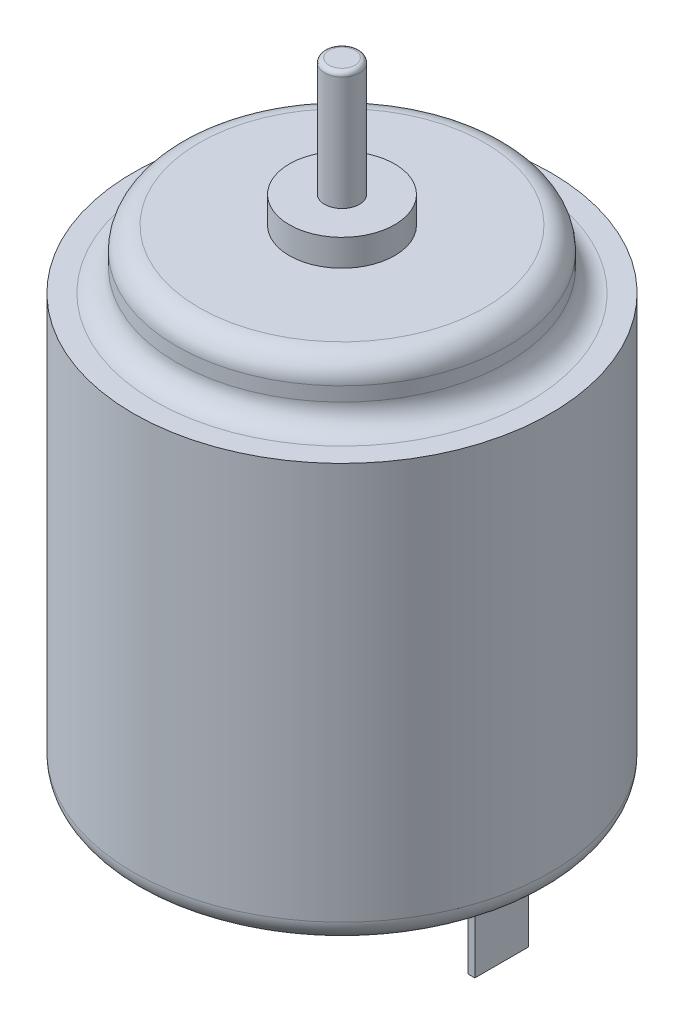
ISO-10303-21;
HEADER;
FILE_DESCRIPTION(('STEP AP214'),'2;1');
FILE_NAME('part.step','',(''),(''),'','','');
FILE_SCHEMA(('AUTOMOTIVE_DESIGN { 1 0 10303 214 1 1 1 1 }'));
ENDSEC;
DATA;
#1=APPLICATION_CONTEXT('core data for automotive mechanical design processes');
#2=APPLICATION_PROTOCOL_DEFINITION('international standard','automotive_design',2000,#1);
#3=PRODUCT_CONTEXT('',#1,'mechanical');
#4=PRODUCT('Part','Part','',(#3));
#5=PRODUCT_RELATED_PRODUCT_CATEGORY('part','',(#4));
#6=PRODUCT_DEFINITION_FORMATION('','',#4);
#7=PRODUCT_DEFINITION_CONTEXT('part definition',#1,'design');
#8=PRODUCT_DEFINITION('design','',#6,#7);
#9=PRODUCT_DEFINITION_SHAPE('','',#8);
#10=(LENGTH_UNIT() NAMED_UNIT(*) SI_UNIT(.MILLI.,.METRE.));
#11=(NAMED_UNIT(*) PLANE_ANGLE_UNIT() SI_UNIT($,.RADIAN.));
#12=(NAMED_UNIT(*) SI_UNIT($,.STERADIAN.) SOLID_ANGLE_UNIT());
#13=UNCERTAINTY_MEASURE_WITH_UNIT(LENGTH_MEASURE(1.E-05),#10,'distance_accuracy_value','');
#14=(GEOMETRIC_REPRESENTATION_CONTEXT(3) GLOBAL_UNCERTAINTY_ASSIGNED_CONTEXT((#13)) GLOBAL_UNIT_ASSIGNED_CONTEXT((#10,
#11,#12)) REPRESENTATION_CONTEXT('',''));
#15=CARTESIAN_POINT('',(0.,0.,0.));
#16=DIRECTION('',(0.,0.,1.));
#17=DIRECTION('',(1.,0.,0.));
#18=AXIS2_PLACEMENT_3D('',#15,#16,#17);
#19=CARTESIAN_POINT('',(0.,0.,0.));
#20=DIRECTION('',(0.,1.,0.));
#21=DIRECTION('',(0.,0.,1.));
#22=AXIS2_PLACEMENT_3D('',#19,#20,#21);
#23=PLANE('',#22);
#24=CARTESIAN_POINT('',(0.,0.,0.));
#25=DIRECTION('',(0.,1.,0.));
#26=DIRECTION('',(0.,0.,1.));
#27=AXIS2_PLACEMENT_3D('',#24,#25,#26);
#28=CIRCLE('',#27,10.6045);
#29=CARTESIAN_POINT('',(0.,0.,10.6045));
#30=VERTEX_POINT('',#29);
#31=EDGE_CURVE('E204',#30,#30,#28,.F.);
#32=ORIENTED_EDGE('',*,*,#31,.T.);
#33=EDGE_LOOP('',(#32));
#34=FACE_BOUND('',#33,.T.);
#35=DIRECTION('',(0.,0.,-1.));
#36=VECTOR('',#35,1.);
#37=CARTESIAN_POINT('',(-9.0805,0.,1.52400000000001));
#38=LINE('',#37,#36);
#39=CARTESIAN_POINT('',(-9.0805,0.,1.52400000000001));
#40=VERTEX_POINT('',#39);
#41=CARTESIAN_POINT('',(-9.0805,0.,-1.52399999999999));
#42=VERTEX_POINT('',#41);
#43=EDGE_CURVE('E135',#40,#42,#38,.T.);
#44=ORIENTED_EDGE('',*,*,#43,.F.);
#45=DIRECTION('',(-1.,0.,0.));
#46=VECTOR('',#45,1.);
#47=CARTESIAN_POINT('',(-8.6995,0.,1.52400000000001));
#48=LINE('',#47,#46);
#49=CARTESIAN_POINT('',(-8.6995,0.,1.52400000000001));
#50=VERTEX_POINT('',#49);
#51=EDGE_CURVE('E148',#50,#40,#48,.T.);
#52=ORIENTED_EDGE('',*,*,#51,.F.);
#53=DIRECTION('',(0.,0.,1.));
#54=VECTOR('',#53,1.);
#55=CARTESIAN_POINT('',(-8.6995,0.,1.52400000000001));
#56=LINE('',#55,#54);
#57=CARTESIAN_POINT('',(-8.6995,0.,-1.52399999999999));
#58=VERTEX_POINT('',#57);
#59=EDGE_CURVE('E157',#58,#50,#56,.T.);
#60=ORIENTED_EDGE('',*,*,#59,.F.);
#61=DIRECTION('',(1.,0.,0.));
#62=VECTOR('',#61,1.);
#63=CARTESIAN_POINT('',(-8.6995,0.,-1.52399999999999));
#64=LINE('',#63,#62);
#65=EDGE_CURVE('E138',#42,#58,#64,.T.);
#66=ORIENTED_EDGE('',*,*,#65,.F.);
#67=EDGE_LOOP('',(#44,#52,#60,#66));
#68=FACE_BOUND('',#67,.T.);
#69=CARTESIAN_POINT('',(0.,0.,0.));
#70=DIRECTION('',(0.,1.,0.));
#71=DIRECTION('',(0.,0.,1.));
#72=AXIS2_PLACEMENT_3D('',#69,#70,#71);
#73=CIRCLE('',#72,4.2926);
#74=CARTESIAN_POINT('',(-2.16198617016854,0.,3.7084));
#75=VERTEX_POINT('',#74);
#76=CARTESIAN_POINT('',(2.16198617016854,0.,3.7084));
#77=VERTEX_POINT('',#76);
#78=EDGE_CURVE('E198',#75,#77,#73,.F.);
#79=ORIENTED_EDGE('',*,*,#78,.F.);
#80=DIRECTION('',(1.,0.,0.));
#81=VECTOR('',#80,1.);
#82=CARTESIAN_POINT('',(2.16198617016854,0.,3.7084));
#83=LINE('',#82,#81);
#84=EDGE_CURVE('E174',#75,#77,#83,.T.);
#85=ORIENTED_EDGE('',*,*,#84,.T.);
#86=EDGE_LOOP('',(#79,#85));
#87=FACE_BOUND('',#86,.T.);
#88=DIRECTION('',(0.,0.,-1.));
#89=VECTOR('',#88,1.);
#90=CARTESIAN_POINT('',(8.6995,0.,1.52400000000001));
#91=LINE('',#90,#89);
#92=CARTESIAN_POINT('',(8.6995,0.,1.52400000000001));
#93=VERTEX_POINT('',#92);
#94=CARTESIAN_POINT('',(8.6995,0.,-1.52399999999999));
#95=VERTEX_POINT('',#94);
#96=EDGE_CURVE('E134',#93,#95,#91,.T.);
#97=ORIENTED_EDGE('',*,*,#96,.F.);
#98=DIRECTION('',(-1.,0.,0.));
#99=VECTOR('',#98,1.);
#100=CARTESIAN_POINT('',(8.6995,0.,1.52400000000001));
#101=LINE('',#100,#99);
#102=CARTESIAN_POINT('',(9.0805,0.,1.52400000000001));
#103=VERTEX_POINT('',#102);
#104=EDGE_CURVE('E131',#103,#93,#101,.T.);
#105=ORIENTED_EDGE('',*,*,#104,.F.);
#106=DIRECTION('',(0.,0.,1.));
#107=VECTOR('',#106,1.);
#108=CARTESIAN_POINT('',(9.0805,0.,1.52400000000001));
#109=LINE('',#108,#107);
#110=CARTESIAN_POINT('',(9.0805,0.,-1.52399999999999));
#111=VERTEX_POINT('',#110);
#112=EDGE_CURVE('E57',#111,#103,#109,.T.);
#113=ORIENTED_EDGE('',*,*,#112,.F.);
#114=DIRECTION('',(1.,0.,0.));
#115=VECTOR('',#114,1.);
#116=CARTESIAN_POINT('',(8.6995,0.,-1.52399999999999));
#117=LINE('',#116,#115);
#118=EDGE_CURVE('E52',#95,#111,#117,.T.);
#119=ORIENTED_EDGE('',*,*,#118,.F.);
#120=EDGE_LOOP('',(#97,#105,#113,#119));
#121=FACE_BOUND('',#120,.T.);
#122=ADVANCED_FACE('F37',(#34,#68,#87,#121),#23,.F.);
#123=CARTESIAN_POINT('',(0.,23.876,0.));
#124=DIRECTION('',(0.,-1.,0.));
#125=DIRECTION('',(0.,0.,-1.));
#126=AXIS2_PLACEMENT_3D('',#123,#124,#125);
#127=CYLINDRICAL_SURFACE('',#126,11.8745);
#128=CARTESIAN_POINT('',(0.,1.27,0.));
#129=DIRECTION('',(0.,1.,0.));
#130=DIRECTION('',(0.,0.,1.));
#131=AXIS2_PLACEMENT_3D('',#128,#129,#130);
#132=CIRCLE('',#131,11.8745);
#133=CARTESIAN_POINT('',(0.,1.27,11.8745));
#134=VERTEX_POINT('',#133);
#135=EDGE_CURVE('E201',#134,#134,#132,.T.);
#136=ORIENTED_EDGE('',*,*,#135,.T.);
#137=EDGE_LOOP('',(#136));
#138=FACE_BOUND('',#137,.T.);
#139=CARTESIAN_POINT('',(0.,23.876,0.));
#140=DIRECTION('',(0.,1.,0.));
#141=DIRECTION('',(0.,0.,1.));
#142=AXIS2_PLACEMENT_3D('',#139,#140,#141);
#143=CIRCLE('',#142,11.8745);
#144=CARTESIAN_POINT('',(0.,23.876,11.8745));
#145=VERTEX_POINT('',#144);
#146=EDGE_CURVE('E193',#145,#145,#143,.T.);
#147=ORIENTED_EDGE('',*,*,#146,.F.);
#148=EDGE_LOOP('',(#147));
#149=FACE_BOUND('',#148,.T.);
#150=ADVANCED_FACE('F233',(#138,#149),#127,.T.);
#151=CARTESIAN_POINT('',(0.,23.876,0.));
#152=DIRECTION('',(0.,1.,0.));
#153=DIRECTION('',(0.,0.,1.));
#154=AXIS2_PLACEMENT_3D('',#151,#152,#153);
#155=PLANE('',#154);
#156=CARTESIAN_POINT('',(0.,23.876,0.));
#157=DIRECTION('',(0.,1.,0.));
#158=DIRECTION('',(0.,0.,1.));
#159=AXIS2_PLACEMENT_3D('',#156,#157,#158);
#160=CIRCLE('',#159,10.668);
#161=CARTESIAN_POINT('',(0.,23.876,10.668));
#162=VERTEX_POINT('',#161);
#163=EDGE_CURVE('E216',#162,#162,#160,.F.);
#164=ORIENTED_EDGE('',*,*,#163,.T.);
#165=EDGE_LOOP('',(#164));
#166=FACE_BOUND('',#165,.T.);
#167=ORIENTED_EDGE('',*,*,#146,.T.);
#168=EDGE_LOOP('',(#167));
#169=FACE_BOUND('',#168,.T.);
#170=ADVANCED_FACE('F239',(#166,#169),#155,.T.);
#171=CARTESIAN_POINT('',(0.,27.2161,0.));
#172=DIRECTION('',(0.,-1.,0.));
#173=DIRECTION('',(0.,0.,-1.));
#174=AXIS2_PLACEMENT_3D('',#171,#172,#173);
#175=CYLINDRICAL_SURFACE('',#174,9.398);
#176=CARTESIAN_POINT('',(0.,25.9461,0.));
#177=DIRECTION('',(0.,1.,0.));
#178=DIRECTION('',(0.,0.,1.));
#179=AXIS2_PLACEMENT_3D('',#176,#177,#178);
#180=CIRCLE('',#179,9.398);
#181=CARTESIAN_POINT('',(0.,25.9461,9.398));
#182=VERTEX_POINT('',#181);
#183=EDGE_CURVE('E213',#182,#182,#180,.F.);
#184=ORIENTED_EDGE('',*,*,#183,.T.);
#185=EDGE_LOOP('',(#184));
#186=FACE_BOUND('',#185,.T.);
#187=CARTESIAN_POINT('',(0.,25.146,0.));
#188=DIRECTION('',(0.,1.,0.));
#189=DIRECTION('',(0.,0.,1.));
#190=AXIS2_PLACEMENT_3D('',#187,#188,#189);
#191=CIRCLE('',#190,9.398);
#192=CARTESIAN_POINT('',(0.,25.146,9.398));
#193=VERTEX_POINT('',#192);
#194=EDGE_CURVE('E210',#193,#193,#191,.T.);
#195=ORIENTED_EDGE('',*,*,#194,.T.);
#196=EDGE_LOOP('',(#195));
#197=FACE_BOUND('',#196,.T.);
#198=ADVANCED_FACE('F262',(#186,#197),#175,.T.);
#199=CARTESIAN_POINT('',(0.,27.2161,0.));
#200=DIRECTION('',(0.,1.,0.));
#201=DIRECTION('',(0.,0.,1.));
#202=AXIS2_PLACEMENT_3D('',#199,#200,#201);
#203=PLANE('',#202);
#204=CARTESIAN_POINT('',(0.,27.2161,0.));
#205=DIRECTION('',(0.,1.,0.));
#206=DIRECTION('',(0.,0.,1.));
#207=AXIS2_PLACEMENT_3D('',#204,#205,#206);
#208=CIRCLE('',#207,8.128);
#209=CARTESIAN_POINT('',(0.,27.2161,8.128));
#210=VERTEX_POINT('',#209);
#211=EDGE_CURVE('E207',#210,#210,#208,.T.);
#212=ORIENTED_EDGE('',*,*,#211,.T.);
#213=EDGE_LOOP('',(#212));
#214=FACE_BOUND('',#213,.T.);
#215=CARTESIAN_POINT('',(0.,27.2161,0.));
#216=DIRECTION('',(0.,1.,0.));
#217=DIRECTION('',(0.,0.,1.));
#218=AXIS2_PLACEMENT_3D('',#215,#216,#217);
#219=CIRCLE('',#218,2.9972);
#220=CARTESIAN_POINT('',(0.,27.2161,2.9972));
#221=VERTEX_POINT('',#220);
#222=EDGE_CURVE('E189',#221,#221,#219,.T.);
#223=ORIENTED_EDGE('',*,*,#222,.F.);
#224=EDGE_LOOP('',(#223));
#225=FACE_BOUND('',#224,.T.);
#226=ADVANCED_FACE('F258',(#214,#225),#203,.T.);
#227=CARTESIAN_POINT('',(0.,28.7401,0.));
#228=DIRECTION('',(0.,-1.,0.));
#229=DIRECTION('',(0.,0.,-1.));
#230=AXIS2_PLACEMENT_3D('',#227,#228,#229);
#231=CYLINDRICAL_SURFACE('',#230,2.9972);
#232=CARTESIAN_POINT('',(0.,28.7401,0.));
#233=DIRECTION('',(0.,1.,0.));
#234=DIRECTION('',(0.,0.,1.));
#235=AXIS2_PLACEMENT_3D('',#232,#233,#234);
#236=CIRCLE('',#235,2.9972);
#237=CARTESIAN_POINT('',(0.,28.7401,2.9972));
#238=VERTEX_POINT('',#237);
#239=EDGE_CURVE('E190',#238,#238,#236,.T.);
#240=ORIENTED_EDGE('',*,*,#239,.F.);
#241=EDGE_LOOP('',(#240));
#242=FACE_BOUND('',#241,.T.);
#243=ORIENTED_EDGE('',*,*,#222,.T.);
#244=EDGE_LOOP('',(#243));
#245=FACE_BOUND('',#244,.T.);
#246=ADVANCED_FACE('F261',(#242,#245),#231,.T.);
#247=CARTESIAN_POINT('',(0.,28.7401,0.));
#248=DIRECTION('',(0.,1.,0.));
#249=DIRECTION('',(0.,0.,1.));
#250=AXIS2_PLACEMENT_3D('',#247,#248,#249);
#251=PLANE('',#250);
#252=CARTESIAN_POINT('',(0.,28.7401,0.));
#253=DIRECTION('',(0.,1.,0.));
#254=DIRECTION('',(0.,0.,1.));
#255=AXIS2_PLACEMENT_3D('',#252,#253,#254);
#256=CIRCLE('',#255,0.9906);
#257=CARTESIAN_POINT('',(0.,28.7401,0.9906));
#258=VERTEX_POINT('',#257);
#259=EDGE_CURVE('E186',#258,#258,#256,.T.);
#260=ORIENTED_EDGE('',*,*,#259,.F.);
#261=EDGE_LOOP('',(#260));
#262=FACE_BOUND('',#261,.T.);
#263=ORIENTED_EDGE('',*,*,#239,.T.);
#264=EDGE_LOOP('',(#263));
#265=FACE_BOUND('',#264,.T.);
#266=ADVANCED_FACE('F267',(#262,#265),#251,.T.);
#267=CARTESIAN_POINT('',(0.,35.4711,0.));
#268=DIRECTION('',(0.,-1.,0.));
#269=DIRECTION('',(0.,0.,-1.));
#270=AXIS2_PLACEMENT_3D('',#267,#268,#269);
#271=CYLINDRICAL_SURFACE('',#270,0.9906);
#272=CARTESIAN_POINT('',(0.,35.2171,0.));
#273=DIRECTION('',(0.,1.,0.));
#274=DIRECTION('',(0.,0.,1.));
#275=AXIS2_PLACEMENT_3D('',#272,#273,#274);
#276=CIRCLE('',#275,0.9906);
#277=CARTESIAN_POINT('',(0.,35.2171,0.9906));
#278=VERTEX_POINT('',#277);
#279=EDGE_CURVE('E11',#278,#278,#276,.F.);
#280=ORIENTED_EDGE('',*,*,#279,.T.);
#281=EDGE_LOOP('',(#280));
#282=FACE_BOUND('',#281,.T.);
#283=ORIENTED_EDGE('',*,*,#259,.T.);
#284=EDGE_LOOP('',(#283));
#285=FACE_BOUND('',#284,.T.);
#286=ADVANCED_FACE('F273',(#282,#285),#271,.T.);
#287=CARTESIAN_POINT('',(0.,35.4711,0.));
#288=DIRECTION('',(0.,1.,0.));
#289=DIRECTION('',(0.,0.,1.));
#290=AXIS2_PLACEMENT_3D('',#287,#288,#289);
#291=PLANE('',#290);
#292=CARTESIAN_POINT('',(0.,35.4711,0.));
#293=DIRECTION('',(0.,1.,0.));
#294=DIRECTION('',(0.,0.,1.));
#295=AXIS2_PLACEMENT_3D('',#292,#293,#294);
#296=CIRCLE('',#295,0.7366);
#297=CARTESIAN_POINT('',(0.,35.4711,0.7366));
#298=VERTEX_POINT('',#297);
#299=EDGE_CURVE('E45',#298,#298,#296,.T.);
#300=ORIENTED_EDGE('',*,*,#299,.T.);
#301=EDGE_LOOP('',(#300));
#302=FACE_BOUND('',#301,.T.);
#303=ADVANCED_FACE('F221',(#302),#291,.T.);
#304=CARTESIAN_POINT('',(0.,-2.032,0.));
#305=DIRECTION('',(0.,1.,0.));
#306=DIRECTION('',(0.,0.,1.));
#307=AXIS2_PLACEMENT_3D('',#304,#305,#306);
#308=CYLINDRICAL_SURFACE('',#307,4.2926);
#309=CARTESIAN_POINT('',(0.,-2.032,0.));
#310=DIRECTION('',(0.,-1.,0.));
#311=DIRECTION('',(0.,0.,-1.));
#312=AXIS2_PLACEMENT_3D('',#309,#310,#311);
#313=CIRCLE('',#312,4.2926);
#314=CARTESIAN_POINT('',(-2.16198617016854,-2.032,3.7084));
#315=VERTEX_POINT('',#314);
#316=CARTESIAN_POINT('',(2.16198617016854,-2.032,3.7084));
#317=VERTEX_POINT('',#316);
#318=EDGE_CURVE('E182',#315,#317,#313,.T.);
#319=ORIENTED_EDGE('',*,*,#318,.F.);
#320=DIRECTION('',(0.,-1.,0.));
#321=VECTOR('',#320,1.);
#322=CARTESIAN_POINT('',(-2.16198617016854,0.,3.7084));
#323=LINE('',#322,#321);
#324=EDGE_CURVE('E177',#75,#315,#323,.T.);
#325=ORIENTED_EDGE('',*,*,#324,.F.);
#326=ORIENTED_EDGE('',*,*,#78,.T.);
#327=DIRECTION('',(0.,-1.,0.));
#328=VECTOR('',#327,1.);
#329=CARTESIAN_POINT('',(2.16198617016854,0.,3.7084));
#330=LINE('',#329,#328);
#331=EDGE_CURVE('E179',#77,#317,#330,.T.);
#332=ORIENTED_EDGE('',*,*,#331,.T.);
#333=EDGE_LOOP('',(#319,#325,#326,#332));
#334=FACE_BOUND('',#333,.T.);
#335=ADVANCED_FACE('F423',(#334),#308,.T.);
#336=CARTESIAN_POINT('',(0.,-2.032,0.));
#337=DIRECTION('',(0.,-1.,0.));
#338=DIRECTION('',(0.,0.,-1.));
#339=AXIS2_PLACEMENT_3D('',#336,#337,#338);
#340=PLANE('',#339);
#341=DIRECTION('',(1.,0.,0.));
#342=VECTOR('',#341,1.);
#343=CARTESIAN_POINT('',(2.16198617016854,-2.032,3.7084));
#344=LINE('',#343,#342);
#345=EDGE_CURVE('E173',#315,#317,#344,.T.);
#346=ORIENTED_EDGE('',*,*,#345,.F.);
#347=ORIENTED_EDGE('',*,*,#318,.T.);
#348=EDGE_LOOP('',(#346,#347));
#349=FACE_BOUND('',#348,.T.);
#350=ADVANCED_FACE('F414',(#349),#340,.T.);
#351=CARTESIAN_POINT('',(2.16198617016854,0.,3.7084));
#352=DIRECTION('',(0.,0.,-1.));
#353=DIRECTION('',(-1.,0.,0.));
#354=AXIS2_PLACEMENT_3D('',#351,#352,#353);
#355=PLANE('',#354);
#356=ORIENTED_EDGE('',*,*,#345,.T.);
#357=ORIENTED_EDGE('',*,*,#331,.F.);
#358=ORIENTED_EDGE('',*,*,#84,.F.);
#359=ORIENTED_EDGE('',*,*,#324,.T.);
#360=EDGE_LOOP('',(#356,#357,#358,#359));
#361=FACE_BOUND('',#360,.T.);
#362=ADVANCED_FACE('F407',(#361),#355,.F.);
#363=CARTESIAN_POINT('',(-9.0805,-4.572,1.52400000000001));
#364=DIRECTION('',(1.,0.,0.));
#365=DIRECTION('',(0.,0.,-1.));
#366=AXIS2_PLACEMENT_3D('',#363,#364,#365);
#367=PLANE('',#366);
#368=ORIENTED_EDGE('',*,*,#43,.T.);
#369=DIRECTION('',(0.,1.,0.));
#370=VECTOR('',#369,1.);
#371=CARTESIAN_POINT('',(-9.0805,-4.572,-1.52399999999999));
#372=LINE('',#371,#370);
#373=CARTESIAN_POINT('',(-9.0805,-4.572,-1.52399999999999));
#374=VERTEX_POINT('',#373);
#375=EDGE_CURVE('E170',#374,#42,#372,.T.);
#376=ORIENTED_EDGE('',*,*,#375,.F.);
#377=DIRECTION('',(0.,0.,-1.));
#378=VECTOR('',#377,1.);
#379=CARTESIAN_POINT('',(-9.0805,-4.572,1.52400000000001));
#380=LINE('',#379,#378);
#381=CARTESIAN_POINT('',(-9.0805,-4.572,1.52400000000001));
#382=VERTEX_POINT('',#381);
#383=EDGE_CURVE('E144',#382,#374,#380,.T.);
#384=ORIENTED_EDGE('',*,*,#383,.F.);
#385=DIRECTION('',(0.,1.,0.));
#386=VECTOR('',#385,1.);
#387=CARTESIAN_POINT('',(-9.0805,-4.572,1.52400000000001));
#388=LINE('',#387,#386);
#389=EDGE_CURVE('E153',#382,#40,#388,.T.);
#390=ORIENTED_EDGE('',*,*,#389,.T.);
#391=EDGE_LOOP('',(#368,#376,#384,#390));
#392=FACE_BOUND('',#391,.T.);
#393=ADVANCED_FACE('F400',(#392),#367,.F.);
#394=CARTESIAN_POINT('',(-8.6995,-4.572,-1.52399999999999));
#395=DIRECTION('',(0.,0.,1.));
#396=DIRECTION('',(1.,0.,0.));
#397=AXIS2_PLACEMENT_3D('',#394,#395,#396);
#398=PLANE('',#397);
#399=ORIENTED_EDGE('',*,*,#65,.T.);
#400=DIRECTION('',(0.,1.,0.));
#401=VECTOR('',#400,1.);
#402=CARTESIAN_POINT('',(-8.6995,-4.572,-1.52399999999999));
#403=LINE('',#402,#401);
#404=CARTESIAN_POINT('',(-8.6995,-4.572,-1.52399999999999));
#405=VERTEX_POINT('',#404);
#406=EDGE_CURVE('E167',#405,#58,#403,.T.);
#407=ORIENTED_EDGE('',*,*,#406,.F.);
#408=DIRECTION('',(1.,0.,0.));
#409=VECTOR('',#408,1.);
#410=CARTESIAN_POINT('',(-8.6995,-4.572,-1.52399999999999));
#411=LINE('',#410,#409);
#412=EDGE_CURVE('E147',#374,#405,#411,.T.);
#413=ORIENTED_EDGE('',*,*,#412,.F.);
#414=ORIENTED_EDGE('',*,*,#375,.T.);
#415=EDGE_LOOP('',(#399,#407,#413,#414));
#416=FACE_BOUND('',#415,.T.);
#417=ADVANCED_FACE('F392',(#416),#398,.F.);
#418=CARTESIAN_POINT('',(-8.6995,-4.572,1.52400000000001));
#419=DIRECTION('',(-1.,0.,0.));
#420=DIRECTION('',(0.,0.,1.));
#421=AXIS2_PLACEMENT_3D('',#418,#419,#420);
#422=PLANE('',#421);
#423=ORIENTED_EDGE('',*,*,#59,.T.);
#424=DIRECTION('',(0.,1.,0.));
#425=VECTOR('',#424,1.);
#426=CARTESIAN_POINT('',(-8.6995,-4.572,1.52400000000001));
#427=LINE('',#426,#425);
#428=CARTESIAN_POINT('',(-8.6995,-4.572,1.52400000000001));
#429=VERTEX_POINT('',#428);
#430=EDGE_CURVE('E164',#429,#50,#427,.T.);
#431=ORIENTED_EDGE('',*,*,#430,.F.);
#432=DIRECTION('',(0.,0.,1.));
#433=VECTOR('',#432,1.);
#434=CARTESIAN_POINT('',(-8.6995,-4.572,1.52400000000001));
#435=LINE('',#434,#433);
#436=EDGE_CURVE('E150',#405,#429,#435,.T.);
#437=ORIENTED_EDGE('',*,*,#436,.F.);
#438=ORIENTED_EDGE('',*,*,#406,.T.);
#439=EDGE_LOOP('',(#423,#431,#437,#438));
#440=FACE_BOUND('',#439,.T.);
#441=ADVANCED_FACE('F385',(#440),#422,.F.);
#442=CARTESIAN_POINT('',(-8.6995,-4.572,1.52400000000001));
#443=DIRECTION('',(0.,0.,-1.));
#444=DIRECTION('',(-1.,0.,0.));
#445=AXIS2_PLACEMENT_3D('',#442,#443,#444);
#446=PLANE('',#445);
#447=ORIENTED_EDGE('',*,*,#51,.T.);
#448=ORIENTED_EDGE('',*,*,#389,.F.);
#449=DIRECTION('',(-1.,0.,0.));
#450=VECTOR('',#449,1.);
#451=CARTESIAN_POINT('',(-8.6995,-4.572,1.52400000000001));
#452=LINE('',#451,#450);
#453=EDGE_CURVE('E152',#429,#382,#452,.T.);
#454=ORIENTED_EDGE('',*,*,#453,.F.);
#455=ORIENTED_EDGE('',*,*,#430,.T.);
#456=EDGE_LOOP('',(#447,#448,#454,#455));
#457=FACE_BOUND('',#456,.T.);
#458=ADVANCED_FACE('F376',(#457),#446,.F.);
#459=CARTESIAN_POINT('',(0.,-4.572,0.));
#460=DIRECTION('',(0.,1.,0.));
#461=DIRECTION('',(0.,0.,1.));
#462=AXIS2_PLACEMENT_3D('',#459,#460,#461);
#463=PLANE('',#462);
#464=ORIENTED_EDGE('',*,*,#383,.T.);
#465=ORIENTED_EDGE('',*,*,#412,.T.);
#466=ORIENTED_EDGE('',*,*,#436,.T.);
#467=ORIENTED_EDGE('',*,*,#453,.T.);
#468=EDGE_LOOP('',(#464,#465,#466,#467));
#469=FACE_BOUND('',#468,.T.);
#470=ADVANCED_FACE('F369',(#469),#463,.F.);
#471=CARTESIAN_POINT('',(8.6995,-4.572,1.52400000000001));
#472=DIRECTION('',(1.,0.,0.));
#473=DIRECTION('',(0.,0.,-1.));
#474=AXIS2_PLACEMENT_3D('',#471,#472,#473);
#475=PLANE('',#474);
#476=ORIENTED_EDGE('',*,*,#96,.T.);
#477=DIRECTION('',(0.,1.,0.));
#478=VECTOR('',#477,1.);
#479=CARTESIAN_POINT('',(8.6995,-4.572,-1.52399999999999));
#480=LINE('',#479,#478);
#481=CARTESIAN_POINT('',(8.6995,-4.572,-1.52399999999999));
#482=VERTEX_POINT('',#481);
#483=EDGE_CURVE('E115',#482,#95,#480,.T.);
#484=ORIENTED_EDGE('',*,*,#483,.F.);
#485=DIRECTION('',(0.,0.,-1.));
#486=VECTOR('',#485,1.);
#487=CARTESIAN_POINT('',(8.6995,-4.572,1.52400000000001));
#488=LINE('',#487,#486);
#489=CARTESIAN_POINT('',(8.6995,-4.572,1.52400000000001));
#490=VERTEX_POINT('',#489);
#491=EDGE_CURVE('E122',#490,#482,#488,.T.);
#492=ORIENTED_EDGE('',*,*,#491,.F.);
#493=DIRECTION('',(0.,1.,0.));
#494=VECTOR('',#493,1.);
#495=CARTESIAN_POINT('',(8.6995,-4.572,1.52400000000001));
#496=LINE('',#495,#494);
#497=EDGE_CURVE('E543',#490,#93,#496,.T.);
#498=ORIENTED_EDGE('',*,*,#497,.T.);
#499=EDGE_LOOP('',(#476,#484,#492,#498));
#500=FACE_BOUND('',#499,.T.);
#501=ADVANCED_FACE('F133',(#500),#475,.F.);
#502=CARTESIAN_POINT('',(8.6995,-4.572,-1.52399999999999));
#503=DIRECTION('',(0.,0.,1.));
#504=DIRECTION('',(1.,0.,0.));
#505=AXIS2_PLACEMENT_3D('',#502,#503,#504);
#506=PLANE('',#505);
#507=ORIENTED_EDGE('',*,*,#118,.T.);
#508=DIRECTION('',(0.,1.,0.));
#509=VECTOR('',#508,1.);
#510=CARTESIAN_POINT('',(9.0805,-4.572,-1.52399999999999));
#511=LINE('',#510,#509);
#512=CARTESIAN_POINT('',(9.0805,-4.572,-1.52399999999999));
#513=VERTEX_POINT('',#512);
#514=EDGE_CURVE('E118',#513,#111,#511,.T.);
#515=ORIENTED_EDGE('',*,*,#514,.F.);
#516=DIRECTION('',(1.,0.,0.));
#517=VECTOR('',#516,1.);
#518=CARTESIAN_POINT('',(8.6995,-4.572,-1.52399999999999));
#519=LINE('',#518,#517);
#520=EDGE_CURVE('E111',#482,#513,#519,.T.);
#521=ORIENTED_EDGE('',*,*,#520,.F.);
#522=ORIENTED_EDGE('',*,*,#483,.T.);
#523=EDGE_LOOP('',(#507,#515,#521,#522));
#524=FACE_BOUND('',#523,.T.);
#525=ADVANCED_FACE('F113',(#524),#506,.F.);
#526=CARTESIAN_POINT('',(9.0805,-4.572,1.52400000000001));
#527=DIRECTION('',(-1.,0.,0.));
#528=DIRECTION('',(0.,0.,1.));
#529=AXIS2_PLACEMENT_3D('',#526,#527,#528);
#530=PLANE('',#529);
#531=ORIENTED_EDGE('',*,*,#112,.T.);
#532=DIRECTION('',(0.,1.,0.));
#533=VECTOR('',#532,1.);
#534=CARTESIAN_POINT('',(9.0805,-4.572,1.52400000000001));
#535=LINE('',#534,#533);
#536=CARTESIAN_POINT('',(9.0805,-4.572,1.52400000000001));
#537=VERTEX_POINT('',#536);
#538=EDGE_CURVE('E140',#537,#103,#535,.T.);
#539=ORIENTED_EDGE('',*,*,#538,.F.);
#540=DIRECTION('',(0.,0.,1.));
#541=VECTOR('',#540,1.);
#542=CARTESIAN_POINT('',(9.0805,-4.572,1.52400000000001));
#543=LINE('',#542,#541);
#544=EDGE_CURVE('E121',#513,#537,#543,.T.);
#545=ORIENTED_EDGE('',*,*,#544,.F.);
#546=ORIENTED_EDGE('',*,*,#514,.T.);
#547=EDGE_LOOP('',(#531,#539,#545,#546));
#548=FACE_BOUND('',#547,.T.);
#549=ADVANCED_FACE('F348',(#548),#530,.F.);
#550=CARTESIAN_POINT('',(8.6995,-4.572,1.52400000000001));
#551=DIRECTION('',(0.,0.,-1.));
#552=DIRECTION('',(-1.,0.,0.));
#553=AXIS2_PLACEMENT_3D('',#550,#551,#552);
#554=PLANE('',#553);
#555=ORIENTED_EDGE('',*,*,#104,.T.);
#556=ORIENTED_EDGE('',*,*,#497,.F.);
#557=DIRECTION('',(-1.,0.,0.));
#558=VECTOR('',#557,1.);
#559=CARTESIAN_POINT('',(8.6995,-4.572,1.52400000000001));
#560=LINE('',#559,#558);
#561=EDGE_CURVE('E127',#537,#490,#560,.T.);
#562=ORIENTED_EDGE('',*,*,#561,.F.);
#563=ORIENTED_EDGE('',*,*,#538,.T.);
#564=EDGE_LOOP('',(#555,#556,#562,#563));
#565=FACE_BOUND('',#564,.T.);
#566=ADVANCED_FACE('F340',(#565),#554,.F.);
#567=CARTESIAN_POINT('',(0.,-4.572,0.));
#568=DIRECTION('',(0.,-1.,0.));
#569=DIRECTION('',(0.,0.,-1.));
#570=AXIS2_PLACEMENT_3D('',#567,#568,#569);
#571=PLANE('',#570);
#572=ORIENTED_EDGE('',*,*,#491,.T.);
#573=ORIENTED_EDGE('',*,*,#520,.T.);
#574=ORIENTED_EDGE('',*,*,#544,.T.);
#575=ORIENTED_EDGE('',*,*,#561,.T.);
#576=EDGE_LOOP('',(#572,#573,#574,#575));
#577=FACE_BOUND('',#576,.T.);
#578=ADVANCED_FACE('F125',(#577),#571,.T.);
#579=CARTESIAN_POINT('',(0.,1.27,0.));
#580=DIRECTION('',(0.,1.,0.));
#581=DIRECTION('',(0.,0.,1.));
#582=AXIS2_PLACEMENT_3D('',#579,#580,#581);
#583=TOROIDAL_SURFACE('',#582,10.6045,1.27);
#584=ORIENTED_EDGE('',*,*,#31,.F.);
#585=EDGE_LOOP('',(#584));
#586=FACE_BOUND('',#585,.T.);
#587=ORIENTED_EDGE('',*,*,#135,.F.);
#588=EDGE_LOOP('',(#587));
#589=FACE_BOUND('',#588,.T.);
#590=ADVANCED_FACE('F246',(#586,#589),#583,.T.);
#591=CARTESIAN_POINT('',(0.,25.9461,0.));
#592=DIRECTION('',(0.,1.,0.));
#593=DIRECTION('',(0.,0.,1.));
#594=AXIS2_PLACEMENT_3D('',#591,#592,#593);
#595=TOROIDAL_SURFACE('',#594,8.128,1.27);
#596=ORIENTED_EDGE('',*,*,#183,.F.);
#597=EDGE_LOOP('',(#596));
#598=FACE_BOUND('',#597,.T.);
#599=ORIENTED_EDGE('',*,*,#211,.F.);
#600=EDGE_LOOP('',(#599));
#601=FACE_BOUND('',#600,.T.);
#602=ADVANCED_FACE('F229',(#598,#601),#595,.T.);
#603=CARTESIAN_POINT('',(0.,25.146,0.));
#604=DIRECTION('',(0.,1.,0.));
#605=DIRECTION('',(0.,0.,1.));
#606=AXIS2_PLACEMENT_3D('',#603,#604,#605);
#607=TOROIDAL_SURFACE('',#606,10.668,1.27);
#608=ORIENTED_EDGE('',*,*,#163,.F.);
#609=EDGE_LOOP('',(#608));
#610=FACE_BOUND('',#609,.T.);
#611=ORIENTED_EDGE('',*,*,#194,.F.);
#612=EDGE_LOOP('',(#611));
#613=FACE_BOUND('',#612,.T.);
#614=ADVANCED_FACE('F224',(#610,#613),#607,.F.);
#615=CARTESIAN_POINT('',(0.,35.2171,0.));
#616=DIRECTION('',(0.,1.,0.));
#617=DIRECTION('',(0.,0.,1.));
#618=AXIS2_PLACEMENT_3D('',#615,#616,#617);
#619=TOROIDAL_SURFACE('',#618,0.7366,0.254);
#620=ORIENTED_EDGE('',*,*,#279,.F.);
#621=EDGE_LOOP('',(#620));
#622=FACE_BOUND('',#621,.T.);
#623=ORIENTED_EDGE('',*,*,#299,.F.);
#624=EDGE_LOOP('',(#623));
#625=FACE_BOUND('',#624,.T.);
#626=ADVANCED_FACE('F39',(#622,#625),#619,.T.);
#627=CLOSED_SHELL('',(#122,#150,#170,#198,#226,#246,#266,#286,#303,#335,#350,#362,#393,#417,
#441,#458,#470,#501,#525,#549,#566,#578,#590,#602,#614,#626));
#628=MANIFOLD_SOLID_BREP('B2',#627);
#629=ADVANCED_BREP_SHAPE_REPRESENTATION('',(#18,#628),#14);
#630=SHAPE_DEFINITION_REPRESENTATION(#9,#629);
ENDSEC;
END-ISO-10303-21;
